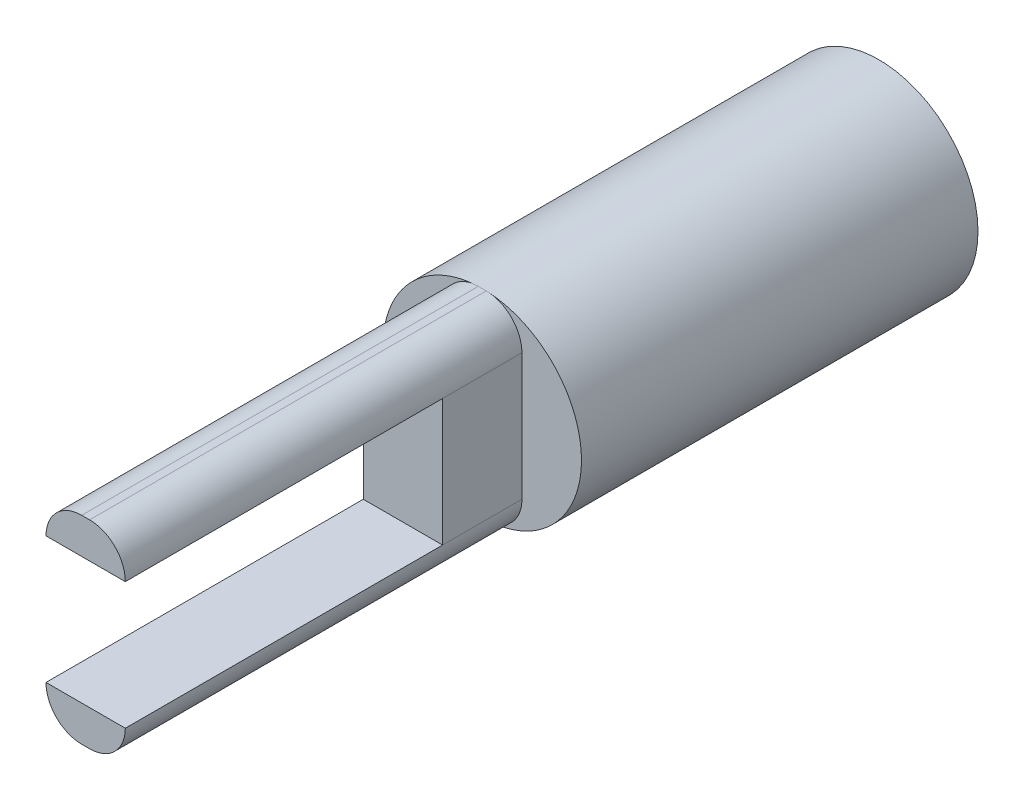
ISO-10303-21;
HEADER;
FILE_DESCRIPTION(('STEP AP214'),'2;1');
FILE_NAME('part.step','',(''),(''),'','','');
FILE_SCHEMA(('AUTOMOTIVE_DESIGN { 1 0 10303 214 1 1 1 1 }'));
ENDSEC;
DATA;
#1=APPLICATION_CONTEXT('core data for automotive mechanical design processes');
#2=APPLICATION_PROTOCOL_DEFINITION('international standard','automotive_design',2000,#1);
#3=PRODUCT_CONTEXT('',#1,'mechanical');
#4=PRODUCT('Part','Part','',(#3));
#5=PRODUCT_RELATED_PRODUCT_CATEGORY('part','',(#4));
#6=PRODUCT_DEFINITION_FORMATION('','',#4);
#7=PRODUCT_DEFINITION_CONTEXT('part definition',#1,'design');
#8=PRODUCT_DEFINITION('design','',#6,#7);
#9=PRODUCT_DEFINITION_SHAPE('','',#8);
#10=(LENGTH_UNIT() NAMED_UNIT(*) SI_UNIT(.MILLI.,.METRE.));
#11=(NAMED_UNIT(*) PLANE_ANGLE_UNIT() SI_UNIT($,.RADIAN.));
#12=(NAMED_UNIT(*) SI_UNIT($,.STERADIAN.) SOLID_ANGLE_UNIT());
#13=UNCERTAINTY_MEASURE_WITH_UNIT(LENGTH_MEASURE(1.E-05),#10,'distance_accuracy_value','');
#14=(GEOMETRIC_REPRESENTATION_CONTEXT(3) GLOBAL_UNCERTAINTY_ASSIGNED_CONTEXT((#13)) GLOBAL_UNIT_ASSIGNED_CONTEXT((#10,
#11,#12)) REPRESENTATION_CONTEXT('',''));
#15=CARTESIAN_POINT('',(0.,0.,0.));
#16=DIRECTION('',(0.,0.,1.));
#17=DIRECTION('',(1.,0.,0.));
#18=AXIS2_PLACEMENT_3D('',#15,#16,#17);
#19=CARTESIAN_POINT('',(-1.,-1.59999999999999,20.));
#20=DIRECTION('',(1.,0.,0.));
#21=DIRECTION('',(0.,0.,-1.));
#22=AXIS2_PLACEMENT_3D('',#19,#20,#21);
#23=PLANE('',#22);
#24=DIRECTION('',(0.,-1.,0.));
#25=VECTOR('',#24,1.);
#26=CARTESIAN_POINT('',(-1.,1.6,12.));
#27=LINE('',#26,#25);
#28=CARTESIAN_POINT('',(-1.,1.6,12.));
#29=VERTEX_POINT('',#28);
#30=CARTESIAN_POINT('',(-1.,-1.59999999999999,12.));
#31=VERTEX_POINT('',#30);
#32=EDGE_CURVE('E140',#29,#31,#27,.T.);
#33=ORIENTED_EDGE('',*,*,#32,.F.);
#34=DIRECTION('',(0.,0.,-1.));
#35=VECTOR('',#34,1.);
#36=CARTESIAN_POINT('',(-1.,1.59999999999999,20.));
#37=LINE('',#36,#35);
#38=CARTESIAN_POINT('',(-1.,1.59999999999999,10.));
#39=VERTEX_POINT('',#38);
#40=EDGE_CURVE('E165',#29,#39,#37,.T.);
#41=ORIENTED_EDGE('',*,*,#40,.T.);
#42=DIRECTION('',(0.,-1.,0.));
#43=VECTOR('',#42,1.);
#44=CARTESIAN_POINT('',(-1.,-1.59999999999999,10.));
#45=LINE('',#44,#43);
#46=CARTESIAN_POINT('',(-1.,-1.6,10.));
#47=VERTEX_POINT('',#46);
#48=EDGE_CURVE('E155',#39,#47,#45,.T.);
#49=ORIENTED_EDGE('',*,*,#48,.T.);
#50=DIRECTION('',(0.,0.,-1.));
#51=VECTOR('',#50,1.);
#52=CARTESIAN_POINT('',(-1.,-1.6,20.));
#53=LINE('',#52,#51);
#54=EDGE_CURVE('E153',#31,#47,#53,.T.);
#55=ORIENTED_EDGE('',*,*,#54,.F.);
#56=EDGE_LOOP('',(#33,#41,#49,#55));
#57=FACE_BOUND('',#56,.T.);
#58=ADVANCED_FACE('F33',(#57),#23,.F.);
#59=CARTESIAN_POINT('',(1.,-1.59999999999999,20.));
#60=DIRECTION('',(-1.,0.,0.));
#61=DIRECTION('',(0.,0.,1.));
#62=AXIS2_PLACEMENT_3D('',#59,#60,#61);
#63=PLANE('',#62);
#64=DIRECTION('',(0.,1.,0.));
#65=VECTOR('',#64,1.);
#66=CARTESIAN_POINT('',(1.,1.6,12.));
#67=LINE('',#66,#65);
#68=CARTESIAN_POINT('',(1.,-1.59999999999999,12.));
#69=VERTEX_POINT('',#68);
#70=CARTESIAN_POINT('',(1.,1.6,12.));
#71=VERTEX_POINT('',#70);
#72=EDGE_CURVE('E139',#69,#71,#67,.T.);
#73=ORIENTED_EDGE('',*,*,#72,.F.);
#74=DIRECTION('',(0.,0.,-1.));
#75=VECTOR('',#74,1.);
#76=CARTESIAN_POINT('',(1.,-1.59999999999999,20.));
#77=LINE('',#76,#75);
#78=CARTESIAN_POINT('',(1.,-1.59999999999999,10.));
#79=VERTEX_POINT('',#78);
#80=EDGE_CURVE('E61',#69,#79,#77,.T.);
#81=ORIENTED_EDGE('',*,*,#80,.T.);
#82=DIRECTION('',(0.,1.,0.));
#83=VECTOR('',#82,1.);
#84=CARTESIAN_POINT('',(1.,-1.59999999999999,10.));
#85=LINE('',#84,#83);
#86=CARTESIAN_POINT('',(1.,1.59999999999999,10.));
#87=VERTEX_POINT('',#86);
#88=EDGE_CURVE('E295',#79,#87,#85,.T.);
#89=ORIENTED_EDGE('',*,*,#88,.T.);
#90=DIRECTION('',(0.,0.,-1.));
#91=VECTOR('',#90,1.);
#92=CARTESIAN_POINT('',(1.,1.59999999999999,20.));
#93=LINE('',#92,#91);
#94=EDGE_CURVE('E53',#71,#87,#93,.T.);
#95=ORIENTED_EDGE('',*,*,#94,.F.);
#96=EDGE_LOOP('',(#73,#81,#89,#95));
#97=FACE_BOUND('',#96,.T.);
#98=ADVANCED_FACE('F203',(#97),#63,.F.);
#99=CARTESIAN_POINT('',(0.1,1.6,20.));
#100=DIRECTION('',(0.,0.,1.));
#101=DIRECTION('',(1.,0.,0.));
#102=AXIS2_PLACEMENT_3D('',#99,#100,#101);
#103=PLANE('',#102);
#104=DIRECTION('',(-1.,0.,0.));
#105=VECTOR('',#104,1.);
#106=CARTESIAN_POINT('',(-1.,1.6,20.));
#107=LINE('',#106,#105);
#108=CARTESIAN_POINT('',(1.,1.6,20.));
#109=VERTEX_POINT('',#108);
#110=CARTESIAN_POINT('',(-1.,1.6,20.));
#111=VERTEX_POINT('',#110);
#112=EDGE_CURVE('E150',#109,#111,#107,.T.);
#113=ORIENTED_EDGE('',*,*,#112,.F.);
#114=CARTESIAN_POINT('',(0.1,1.6,20.));
#115=DIRECTION('',(0.,0.,1.));
#116=DIRECTION('',(1.,0.,0.));
#117=AXIS2_PLACEMENT_3D('',#114,#115,#116);
#118=CIRCLE('',#117,0.9);
#119=CARTESIAN_POINT('',(0.0999999999999936,2.5,20.));
#120=VERTEX_POINT('',#119);
#121=EDGE_CURVE('E296',#109,#120,#118,.T.);
#122=ORIENTED_EDGE('',*,*,#121,.T.);
#123=DIRECTION('',(-1.,0.,0.));
#124=VECTOR('',#123,1.);
#125=CARTESIAN_POINT('',(-0.0999999999999936,2.5,20.));
#126=LINE('',#125,#124);
#127=CARTESIAN_POINT('',(-0.0999999999999938,2.5,20.));
#128=VERTEX_POINT('',#127);
#129=EDGE_CURVE('E316',#120,#128,#126,.T.);
#130=ORIENTED_EDGE('',*,*,#129,.T.);
#131=CARTESIAN_POINT('',(-0.1,1.6,20.));
#132=DIRECTION('',(0.,0.,1.));
#133=DIRECTION('',(-1.,0.,0.));
#134=AXIS2_PLACEMENT_3D('',#131,#132,#133);
#135=CIRCLE('',#134,0.9);
#136=EDGE_CURVE('E311',#128,#111,#135,.T.);
#137=ORIENTED_EDGE('',*,*,#136,.T.);
#138=EDGE_LOOP('',(#113,#122,#130,#137));
#139=FACE_BOUND('',#138,.T.);
#140=ADVANCED_FACE('F377',(#139),#103,.T.);
#141=CARTESIAN_POINT('',(0.,0.,10.));
#142=DIRECTION('',(0.,0.,1.));
#143=DIRECTION('',(1.,0.,0.));
#144=AXIS2_PLACEMENT_3D('',#141,#142,#143);
#145=PLANE('',#144);
#146=CARTESIAN_POINT('',(0.1,1.6,10.));
#147=DIRECTION('',(0.,0.,1.));
#148=DIRECTION('',(1.,0.,0.));
#149=AXIS2_PLACEMENT_3D('',#146,#147,#148);
#150=CIRCLE('',#149,0.9);
#151=CARTESIAN_POINT('',(0.154200368227142,2.49682906558571,10.));
#152=VERTEX_POINT('',#151);
#153=EDGE_CURVE('E324',#87,#152,#150,.T.);
#154=ORIENTED_EDGE('',*,*,#153,.F.);
#155=ORIENTED_EDGE('',*,*,#88,.F.);
#156=CARTESIAN_POINT('',(0.1,-1.6,10.));
#157=DIRECTION('',(0.,0.,1.));
#158=DIRECTION('',(-1.,0.,0.));
#159=AXIS2_PLACEMENT_3D('',#156,#157,#158);
#160=CIRCLE('',#159,0.9);
#161=CARTESIAN_POINT('',(0.154017291092777,-2.49685384413586,10.));
#162=VERTEX_POINT('',#161);
#163=EDGE_CURVE('E11',#162,#79,#160,.T.);
#164=ORIENTED_EDGE('',*,*,#163,.F.);
#165=CARTESIAN_POINT('',(0.153930582874639,-2.49541422306819,10.));
#166=CARTESIAN_POINT('',(0.180089926284761,-2.49383922626421,10.));
#167=CARTESIAN_POINT('',(0.206224798417091,-2.4918539223842,10.));
#168=CARTESIAN_POINT('',(0.25833882247195,-2.48706577852593,10.));
#169=CARTESIAN_POINT('',(0.284318206176433,-2.48426545984957,10.));
#170=CARTESIAN_POINT('',(0.336121320784231,-2.47784741196672,10.));
#171=CARTESIAN_POINT('',(0.361945262518701,-2.47423138591921,10.));
#172=CARTESIAN_POINT('',(0.413437497695465,-2.46618293559873,10.));
#173=CARTESIAN_POINT('',(0.439105927428948,-2.46175138338467,10.));
#174=CARTESIAN_POINT('',(0.490287233514523,-2.45207266449214,10.));
#175=CARTESIAN_POINT('',(0.515800117571482,-2.44682553855942,10.));
#176=CARTESIAN_POINT('',(0.566670452195333,-2.43551653144054,10.));
#177=CARTESIAN_POINT('',(0.592027729089221,-2.42945386921063,10.));
#178=CARTESIAN_POINT('',(0.642587101938854,-2.41651455770442,10.));
#179=CARTESIAN_POINT('',(0.667788792669843,-2.40963632496809,10.));
#180=CARTESIAN_POINT('',(0.71803700289691,-2.39506685212001,10.));
#181=CARTESIAN_POINT('',(0.74308283826312,-2.38737325559329,10.));
#182=CARTESIAN_POINT('',(0.799791382587595,-2.36897661503234,10.));
#183=CARTESIAN_POINT('',(0.831374865383541,-2.35802861786289,10.));
#184=CARTESIAN_POINT('',(0.89429406573422,-2.33482621795219,10.));
#185=CARTESIAN_POINT('',(0.92562679328646,-2.32256370664804,10.));
#186=CARTESIAN_POINT('',(0.974556859321199,-2.30231135794329,10.));
#187=CARTESIAN_POINT('',(0.992322391073726,-2.29472525694119,10.));
#188=CARTESIAN_POINT('',(1.02760983316791,-2.27918108356142,10.));
#189=CARTESIAN_POINT('',(1.04513241150138,-2.27122452934164,10.));
#190=CARTESIAN_POINT('',(1.08634259303384,-2.25194176950766,10.));
#191=CARTESIAN_POINT('',(1.1099502078175,-2.24044409955656,10.));
#192=CARTESIAN_POINT('',(1.15670821140675,-2.21675216864665,10.));
#193=CARTESIAN_POINT('',(1.17985992215578,-2.2045605155717,10.));
#194=CARTESIAN_POINT('',(1.22570668443226,-2.17948135294655,10.));
#195=CARTESIAN_POINT('',(1.24840275109754,-2.1665956997958,10.));
#196=CARTESIAN_POINT('',(1.29333845844632,-2.14012930365824,10.));
#197=CARTESIAN_POINT('',(1.31557875344578,-2.12654967165225,10.));
#198=CARTESIAN_POINT('',(1.35960332400282,-2.09869605179852,10.));
#199=CARTESIAN_POINT('',(1.38138784071828,-2.08442244514901,10.));
#200=CARTESIAN_POINT('',(1.42450122518608,-2.05518165297406,10.));
#201=CARTESIAN_POINT('',(1.44582987327673,-2.04021414362761,10.));
#202=CARTESIAN_POINT('',(1.48803216709234,-2.00958607132874,10.));
#203=CARTESIAN_POINT('',(1.50890509046508,-1.99392451264988,10.));
#204=CARTESIAN_POINT('',(1.5501957876239,-1.96190966560256,10.));
#205=CARTESIAN_POINT('',(1.57061229912965,-1.94555475243139,10.));
#206=CARTESIAN_POINT('',(1.62140134428726,-1.90354162502265,10.));
#207=CARTESIAN_POINT('',(1.65143177143943,-1.87746711524314,10.));
#208=CARTESIAN_POINT('',(1.69561071206345,-1.83725286010321,10.));
#209=CARTESIAN_POINT('',(1.71023058476098,-1.82362634561539,10.));
#210=CARTESIAN_POINT('',(1.73921162087477,-1.79597817258253,10.));
#211=CARTESIAN_POINT('',(1.75357141296026,-1.78195507516548,10.));
#212=CARTESIAN_POINT('',(1.79100347575016,-1.744542572309,10.));
#213=CARTESIAN_POINT('',(1.8137999006119,-1.7208760233458,10.));
#214=CARTESIAN_POINT('',(1.85832426707491,-1.67281523890592,10.));
#215=CARTESIAN_POINT('',(1.88005767566579,-1.64842606595597,10.));
#216=CARTESIAN_POINT('',(1.92245863415899,-1.59892213899614,10.));
#217=CARTESIAN_POINT('',(1.94313042133099,-1.57381101564894,10.));
#218=CARTESIAN_POINT('',(1.98340922817724,-1.52286407570858,10.));
#219=CARTESIAN_POINT('',(2.0030191049052,-1.49703051963803,10.));
#220=CARTESIAN_POINT('',(2.03744232012034,-1.44976634767625,10.));
#221=CARTESIAN_POINT('',(2.05244011801543,-1.42846978104604,10.));
#222=CARTESIAN_POINT('',(2.08174915428149,-1.38540982655762,10.));
#223=CARTESIAN_POINT('',(2.09606040784157,-1.36364644904256,10.));
#224=CARTESIAN_POINT('',(2.12399696507424,-1.31965326747859,10.));
#225=CARTESIAN_POINT('',(2.13762157393334,-1.29742302199231,10.));
#226=CARTESIAN_POINT('',(2.16418513267205,-1.25249771347051,10.));
#227=CARTESIAN_POINT('',(2.17712265533841,-1.22980180901157,10.));
#228=CARTESIAN_POINT('',(2.211884282756,-1.16651970693797,10.));
#229=CARTESIAN_POINT('',(2.23294739265826,-1.12551092606234,10.));
#230=CARTESIAN_POINT('',(2.26289616565917,-1.06306845287073,10.));
#231=CARTESIAN_POINT('',(2.27263093489886,-1.04203622257871,10.));
#232=CARTESIAN_POINT('',(2.29157494970301,-0.999613052566687,10.));
#233=CARTESIAN_POINT('',(2.30078141182319,-0.978220866424121,10.));
#234=CARTESIAN_POINT('',(2.3210610557865,-0.92929847433432,10.));
#235=CARTESIAN_POINT('',(2.33195402379699,-0.90169338820445,10.));
#236=CARTESIAN_POINT('',(2.35270876437727,-0.846272596702898,10.));
#237=CARTESIAN_POINT('',(2.36257591790481,-0.818458906800408,10.));
#238=CARTESIAN_POINT('',(2.38128118293929,-0.762621839295979,10.));
#239=CARTESIAN_POINT('',(2.39012357832139,-0.734599897389518,10.));
#240=CARTESIAN_POINT('',(2.4067801783159,-0.678346636186886,10.));
#241=CARTESIAN_POINT('',(2.41459749662938,-0.65011623969749,10.));
#242=CARTESIAN_POINT('',(2.42841259624306,-0.596521778576933,10.));
#243=CARTESIAN_POINT('',(2.43451596239188,-0.571184874157975,10.));
#244=CARTESIAN_POINT('',(2.44590793380641,-0.520345499685516,10.));
#245=CARTESIAN_POINT('',(2.45119705965442,-0.494843146373363,10.));
#246=CARTESIAN_POINT('',(2.46096131648891,-0.443673239959407,10.));
#247=CARTESIAN_POINT('',(2.46543614229653,-0.418005628639162,10.));
#248=CARTESIAN_POINT('',(2.47357264417792,-0.366505332987037,10.));
#249=CARTESIAN_POINT('',(2.47723318232403,-0.340672468909194,10.));
#250=CARTESIAN_POINT('',(2.48374082025524,-0.288850631697032,10.));
#251=CARTESIAN_POINT('',(2.48658623326998,-0.26286144686976,10.));
#252=CARTESIAN_POINT('',(2.49146614070186,-0.210718295768028,10.));
#253=CARTESIAN_POINT('',(2.49349785451315,-0.184564069539573,10.));
#254=CARTESIAN_POINT('',(2.49675105763346,-0.132090826751166,10.));
#255=CARTESIAN_POINT('',(2.49796897339933,-0.105771589065961,10.));
#256=CARTESIAN_POINT('',(2.49959579413407,-0.0529683236220053,10.));
#257=CARTESIAN_POINT('',(2.50000036687404,-0.0264841632128635,10.));
#258=CARTESIAN_POINT('',(2.49999963340755,0.0264638359497613,10.));
#259=CARTESIAN_POINT('',(2.49959494856527,0.0529276746989422,10.));
#260=CARTESIAN_POINT('',(2.49796630281903,0.105696739835719,10.));
#261=CARTESIAN_POINT('',(2.49674648279653,0.132002093215178,10.));
#262=CARTESIAN_POINT('',(2.49348874389048,0.184454021371798,10.));
#263=CARTESIAN_POINT('',(2.49145419620235,0.2106008051894,10.));
#264=CARTESIAN_POINT('',(2.48656766936257,0.262735532150638,10.));
#265=CARTESIAN_POINT('',(2.48371826453235,0.288723716331808,10.));
#266=CARTESIAN_POINT('',(2.47720396927173,0.340532420131744,10.));
#267=CARTESIAN_POINT('',(2.47354111365483,0.366353195480873,10.));
#268=CARTESIAN_POINT('',(2.465400184153,0.417836017017924,10.));
#269=CARTESIAN_POINT('',(2.46092303663927,0.443498209659874,10.));
#270=CARTESIAN_POINT('',(2.45115436018615,0.494663949130456,10.));
#271=CARTESIAN_POINT('',(2.44586292852092,0.520167514530534,10.));
#272=CARTESIAN_POINT('',(2.43446650983353,0.571016135102569,10.));
#273=CARTESIAN_POINT('',(2.42836080002875,0.596361028260877,10.));
#274=CARTESIAN_POINT('',(2.4153366605689,0.646892501381537,10.));
#275=CARTESIAN_POINT('',(2.40841670704259,0.672078688490805,10.));
#276=CARTESIAN_POINT('',(2.39376481381975,0.722292961532709,10.));
#277=CARTESIAN_POINT('',(2.38603057728965,0.747320377049497,10.));
#278=CARTESIAN_POINT('',(2.36975111735613,0.797217494616883,10.));
#279=CARTESIAN_POINT('',(2.36120286211719,0.822086207197474,10.));
#280=CARTESIAN_POINT('',(2.3432952091161,0.871665859387557,10.));
#281=CARTESIAN_POINT('',(2.33393208408709,0.896375451944043,10.));
#282=CARTESIAN_POINT('',(2.31442560062624,0.945570776961532,10.));
#283=CARTESIAN_POINT('',(2.30427997796195,0.970055611443603,10.));
#284=CARTESIAN_POINT('',(2.28328920009665,1.01857702347713,10.));
#285=CARTESIAN_POINT('',(2.27244783540735,1.04261524008448,10.));
#286=CARTESIAN_POINT('',(2.25006737970239,1.09023431738435,10.));
#287=CARTESIAN_POINT('',(2.23853160596797,1.11381673659273,10.));
#288=CARTESIAN_POINT('',(2.21476360081217,1.16052464965788,10.));
#289=CARTESIAN_POINT('',(2.20253393577021,1.18365144915422,10.));
#290=CARTESIAN_POINT('',(2.177378766986,1.22944832759491,10.));
#291=CARTESIAN_POINT('',(2.16445507860836,1.25211940349735,10.));
#292=CARTESIAN_POINT('',(2.13791265713354,1.29700517135395,10.));
#293=CARTESIAN_POINT('',(2.12429499452965,1.3192204962643,10.));
#294=CARTESIAN_POINT('',(2.09636536255805,1.36319513345601,10.));
#295=CARTESIAN_POINT('',(2.08205373502554,1.38495466284024,10.));
#296=CARTESIAN_POINT('',(2.05273690243299,1.42801813465652,10.));
#297=CARTESIAN_POINT('',(2.03773133578742,1.4493218309193,10.));
#298=CARTESIAN_POINT('',(2.00702732955732,1.49147411325581,10.));
#299=CARTESIAN_POINT('',(1.99132785877298,1.51232194812709,10.));
#300=CARTESIAN_POINT('',(1.95923668651721,1.55356300017301,10.));
#301=CARTESIAN_POINT('',(1.94284332567712,1.57395492592952,10.));
#302=CARTESIAN_POINT('',(1.90936507009597,1.6142847774765,10.));
#303=CARTESIAN_POINT('',(1.8922779362644,1.63422084420618,10.));
#304=CARTESIAN_POINT('',(1.85741240955289,1.67363927492625,10.));
#305=CARTESIAN_POINT('',(1.83963124988305,1.69311919102908,10.));
#306=CARTESIAN_POINT('',(1.80338095642158,1.73162516033215,10.));
#307=CARTESIAN_POINT('',(1.78490864772928,1.75064822356818,10.));
#308=CARTESIAN_POINT('',(1.74744680667039,1.78806328530264,10.));
#309=CARTESIAN_POINT('',(1.72845900425263,1.80645701567408,10.));
#310=CARTESIAN_POINT('',(1.69001309444968,1.84255435288995,10.));
#311=CARTESIAN_POINT('',(1.67055775154209,1.86026090287892,10.));
#312=CARTESIAN_POINT('',(1.63117829354243,1.89498519293892,10.));
#313=CARTESIAN_POINT('',(1.61125633695889,1.91200538045746,10.));
#314=CARTESIAN_POINT('',(1.5709440139932,1.94535722259717,10.));
#315=CARTESIAN_POINT('',(1.55055522058971,1.96169077810278,10.));
#316=CARTESIAN_POINT('',(1.5093098773615,1.99366997897575,10.));
#317=CARTESIAN_POINT('',(1.48845433729791,2.00931692654073,10.));
#318=CARTESIAN_POINT('',(1.44627604572933,2.039923505725,10.));
#319=CARTESIAN_POINT('',(1.42495377216344,2.05488379594116,10.));
#320=CARTESIAN_POINT('',(1.38184254735877,2.08411771989183,10.));
#321=CARTESIAN_POINT('',(1.36005358051626,2.09839133061548,10.));
#322=CARTESIAN_POINT('',(1.31600945407231,2.12625257919875,10.));
#323=CARTESIAN_POINT('',(1.29375382988149,2.13983948256668,10.));
#324=CARTESIAN_POINT('',(1.24877683690037,2.16632805064451,10.));
#325=CARTESIAN_POINT('',(1.22605460426377,2.17922824837101,10.));
#326=CARTESIAN_POINT('',(1.1801447589005,2.20434407505339,10.));
#327=CARTESIAN_POINT('',(1.15695593663002,2.21655749254647,10.));
#328=CARTESIAN_POINT('',(1.11011333981422,2.24030074521245,10.));
#329=CARTESIAN_POINT('',(1.08645806670937,2.2518276232263,10.));
#330=CARTESIAN_POINT('',(1.03868249407682,2.27419762787573,10.));
#331=CARTESIAN_POINT('',(1.01456046244362,2.28503705332983,10.));
#332=CARTESIAN_POINT('',(0.965936547060644,2.30600025694899,10.));
#333=CARTESIAN_POINT('',(0.941433870060147,2.31612219489074,10.));
#334=CARTESIAN_POINT('',(0.892261314659777,2.33554922474696,10.));
#335=CARTESIAN_POINT('',(0.867593080515431,2.34485847630581,10.));
#336=CARTESIAN_POINT('',(0.818086689632757,2.36266030552615,10.));
#337=CARTESIAN_POINT('',(0.793249766291936,2.37115631179516,10.));
#338=CARTESIAN_POINT('',(0.743406545658868,2.38733275864103,10.));
#339=CARTESIAN_POINT('',(0.718401130764762,2.39501591720509,10.));
#340=CARTESIAN_POINT('',(0.668221230305352,2.4095672777193,10.));
#341=CARTESIAN_POINT('',(0.643047315451914,2.41643744720309,10.));
#342=CARTESIAN_POINT('',(0.592530734417618,2.42936362250044,10.));
#343=CARTESIAN_POINT('',(0.567188370903949,2.43542081095737,10.));
#344=CARTESIAN_POINT('',(0.516335150703122,2.44672181398422,10.));
#345=CARTESIAN_POINT('',(0.490824376865484,2.45196600134111,10.));
#346=CARTESIAN_POINT('',(0.439634551301735,2.46164180805871,10.));
#347=CARTESIAN_POINT('',(0.41395541405787,2.46607297493712,10.));
#348=CARTESIAN_POINT('',(0.362429012927919,2.47412361652418,10.));
#349=CARTESIAN_POINT('',(0.336581548616961,2.47774180819254,10.));
#350=CARTESIAN_POINT('',(0.28471862930197,2.48416715139846,10.));
#351=CARTESIAN_POINT('',(0.258702913238083,2.48697219363253,10.));
#352=CARTESIAN_POINT('',(0.206503426561756,2.4917727299664,10.));
#353=CARTESIAN_POINT('',(0.18031938740135,2.49376530587613,10.));
#354=CARTESIAN_POINT('',(0.154110899409643,2.49534866726747,10.));
#355=B_SPLINE_CURVE_WITH_KNOTS('',3,(#165,#166,#167,#168,#169,#170,#171,#172,#173,#174,#175,
#176,#177,#178,#179,#180,#181,#182,#183,#184,#185,#186,#187,#188,#189,#190,#191,#192,#193,#194,
#195,#196,#197,#198,#199,#200,#201,#202,#203,#204,#205,#206,#207,#208,#209,#210,#211,#212,#213,
#214,#215,#216,#217,#218,#219,#220,#221,#222,#223,#224,#225,#226,#227,#228,#229,#230,#231,#232,
#233,#234,#235,#236,#237,#238,#239,#240,#241,#242,#243,#244,#245,#246,#247,#248,#249,#250,#251,
#252,#253,#254,#255,#256,#257,#258,#259,#260,#261,#262,#263,#264,#265,#266,#267,#268,#269,#270,
#271,#272,#273,#274,#275,#276,#277,#278,#279,#280,#281,#282,#283,#284,#285,#286,#287,#288,#289,
#290,#291,#292,#293,#294,#295,#296,#297,#298,#299,#300,#301,#302,#303,#304,#305,#306,#307,#308,
#309,#310,#311,#312,#313,#314,#315,#316,#317,#318,#319,#320,#321,#322,#323,#324,#325,#326,#327,
#328,#329,#330,#331,#332,#333,#334,#335,#336,#337,#338,#339,#340,#341,#342,#343,#344,#345,#346,
#347,#348,#349,#350,#351,#352,#353,#354),.UNSPECIFIED.,.F.,.F.,(4,2,2,2,2,2,2,2,2,2,2,2,2,2,2,2,
2,2,2,2,2,2,2,2,2,2,2,2,2,2,2,2,2,2,2,2,2,2,2,2,2,2,2,2,2,2,2,2,2,2,2,2,2,2,2,2,2,2,2,2,2,2,2,2,
2,2,2,2,2,2,2,2,2,2,2,2,2,2,2,2,2,2,2,2,2,2,2,2,2,2,2,2,2,2,4),(0.,0.0786172639541156,
0.156993859412629,0.23520829850859,0.313339582216948,0.391466963768667,0.469669708258433,
0.548026852072685,0.626616965771004,0.726871663937678,0.827784867096408,0.88573285151497,
0.94346129148541,1.02222375979768,1.10070762487278,1.17899107767733,1.2571529106412,
1.33527228419817,1.41342848779703,1.49170069896057,1.57016774403852,1.68942800170263,
1.74938036438718,1.8095887360803,1.90814315528659,2.00612145969105,2.1036722131452,
2.20094593848551,2.27907605865793,2.35720444948136,2.43541037298177,2.5137728559174,
2.65199536918737,2.72151644601705,2.79137533562345,2.88038678020224,2.96890486111185,
3.0570384276296,3.14489775817367,3.22306978488981,3.30119162309256,3.37934267933715,
3.45760227124012,3.53602265788787,3.61470878498925,3.69373820620772,3.77318746990301,
3.85257575428499,3.93156378185921,4.01022829380718,4.08864698110142,4.16687167362414,
4.2450079249914,4.32313484945935,4.40133158959311,4.47967707638024,4.55824979253486,
4.63712754249993,4.7163872324238,4.79588555541427,4.87498249775173,4.95372768647338,
5.03219853743014,5.11047328045964,5.18863073427043,5.26675007258961,5.34491058497318,
5.42319143586335,5.50167142553909,5.58042875653955,5.65954080894951,5.73907661647292,
5.81837229435441,5.89727892987266,5.97587346511732,6.05423376153861,6.13243838022275,
6.21056635187966,6.28869693980978,6.36690939935926,6.44528273749569,6.52389547613204,
6.60282542269578,6.68214945119029,6.76167007452788,6.84075635581121,6.91949299192928,
6.99795742393861,7.07622790085868,7.15438325427376,7.23250266428797,7.3106654202392,
7.38895067975981,7.46743722982998,7.54620325339989),.UNSPECIFIED.);
#356=EDGE_CURVE('E293',#162,#152,#355,.T.);
#357=ORIENTED_EDGE('',*,*,#356,.T.);
#358=EDGE_LOOP('',(#154,#155,#164,#357));
#359=FACE_BOUND('',#358,.T.);
#360=ADVANCED_FACE('F247',(#359),#145,.T.);
#361=CARTESIAN_POINT('',(0.,0.,10.));
#362=DIRECTION('',(0.,0.,-1.));
#363=DIRECTION('',(-1.,0.,0.));
#364=AXIS2_PLACEMENT_3D('',#361,#362,#363);
#365=CYLINDRICAL_SURFACE('',#364,2.5);
#366=CARTESIAN_POINT('',(0.1,1.6,10.));
#367=DIRECTION('',(0.,0.,1.));
#368=DIRECTION('',(0.0603255693325492,0.998178754374538,0.));
#369=AXIS2_PLACEMENT_3D('',#366,#367,#368);
#370=CIRCLE('',#369,0.9);
#371=CARTESIAN_POINT('',(0.0999609898911222,2.49900116072349,10.));
#372=VERTEX_POINT('',#371);
#373=EDGE_CURVE('E226',#152,#372,#370,.T.);
#374=ORIENTED_EDGE('',*,*,#373,.F.);
#375=ORIENTED_EDGE('',*,*,#356,.F.);
#376=CARTESIAN_POINT('',(0.1,-1.6,10.));
#377=DIRECTION('',(0.,0.,1.));
#378=DIRECTION('',(0.,-1.,0.));
#379=AXIS2_PLACEMENT_3D('',#376,#377,#378);
#380=CIRCLE('',#379,0.9);
#381=CARTESIAN_POINT('',(0.0999612358594318,-2.49900115088338,10.));
#382=VERTEX_POINT('',#381);
#383=EDGE_CURVE('E290',#382,#162,#380,.T.);
#384=ORIENTED_EDGE('',*,*,#383,.F.);
#385=CARTESIAN_POINT('',(-0.0999999999999936,-2.5,10.));
#386=DIRECTION('',(1.,0.,0.));
#387=VECTOR('',#386,1.);
#388=LINE('',#385,#387);
#389=CARTESIAN_POINT('',(-0.0999609898911218,-2.49900116072349,10.));
#390=VERTEX_POINT('',#389);
#391=EDGE_CURVE('E177',#390,#382,#388,.T.);
#392=ORIENTED_EDGE('',*,*,#391,.F.);
#393=CARTESIAN_POINT('',(-0.1,-1.6,10.));
#394=DIRECTION('',(0.,0.,1.));
#395=DIRECTION('',(-0.0603255693889432,-0.99817875437113,0.));
#396=AXIS2_PLACEMENT_3D('',#393,#394,#395);
#397=CIRCLE('',#396,0.9);
#398=CARTESIAN_POINT('',(-0.154200368277865,-2.49682906558262,10.));
#399=VERTEX_POINT('',#398);
#400=EDGE_CURVE('E366',#399,#390,#397,.T.);
#401=ORIENTED_EDGE('',*,*,#400,.F.);
#402=CARTESIAN_POINT('',(-0.153930556858307,2.49541422463514,10.));
#403=CARTESIAN_POINT('',(-0.193137753729967,2.49305575881048,10.));
#404=CARTESIAN_POINT('',(-0.232290212007418,2.48977229734747,10.));
#405=CARTESIAN_POINT('',(-0.310244427854528,2.48136446141892,10.));
#406=CARTESIAN_POINT('',(-0.349046955139013,2.47624721763132,10.));
#407=CARTESIAN_POINT('',(-0.426301528220296,2.46417246113907,10.));
#408=CARTESIAN_POINT('',(-0.464754034055278,2.45721789451037,10.));
#409=CARTESIAN_POINT('',(-0.541309002728116,2.44147363566876,10.));
#410=CARTESIAN_POINT('',(-0.579411207262782,2.43268268747852,10.));
#411=CARTESIAN_POINT('',(-0.655265891555827,2.41326980379218,10.));
#412=CARTESIAN_POINT('',(-0.693017001114073,2.40264252195267,10.));
#413=CARTESIAN_POINT('',(-0.768172529648739,2.37956044424122,10.));
#414=CARTESIAN_POINT('',(-0.805574122900895,2.3670964276813,10.));
#415=CARTESIAN_POINT('',(-0.861800890141157,2.34689488259641,10.));
#416=CARTESIAN_POINT('',(-0.880855666155556,2.33978943678037,10.));
#417=CARTESIAN_POINT('',(-0.918874360397918,2.32509772581448,10.));
#418=CARTESIAN_POINT('',(-0.937837526351173,2.31750950930865,10.));
#419=CARTESIAN_POINT('',(-0.974556689185645,2.30231154792755,10.));
#420=CARTESIAN_POINT('',(-0.992322401599287,2.29472526738296,10.));
#421=CARTESIAN_POINT('',(-1.02760980173962,2.27918108238473,10.));
#422=CARTESIAN_POINT('',(-1.04513215898331,2.27122469477484,10.));
#423=CARTESIAN_POINT('',(-1.0981984347264,2.24639417610109,10.));
#424=CARTESIAN_POINT('',(-1.13344851670022,2.22888606016889,10.));
#425=CARTESIAN_POINT('',(-1.20291732516407,2.19229985370245,10.));
#426=CARTESIAN_POINT('',(-1.23714002647419,2.17322929804642,10.));
#427=CARTESIAN_POINT('',(-1.30455748799643,2.13352144117865,10.));
#428=CARTESIAN_POINT('',(-1.33775445642181,2.11288789192336,10.));
#429=CARTESIAN_POINT('',(-1.40312184182545,2.07005797333745,10.));
#430=CARTESIAN_POINT('',(-1.43529231418296,2.04786168852396,10.));
#431=CARTESIAN_POINT('',(-1.4986088060186,2.001910164531,10.));
#432=CARTESIAN_POINT('',(-1.52975238498242,1.97815156425927,10.));
#433=CARTESIAN_POINT('',(-1.59101864652625,1.92907789282471,10.));
#434=CARTESIAN_POINT('',(-1.62113612771117,1.90375632271076,10.));
#435=CARTESIAN_POINT('',(-1.67068065750835,1.86008549679719,10.));
#436=CARTESIAN_POINT('',(-1.69043622479554,1.84210704615675,10.));
#437=CARTESIAN_POINT('',(-1.72948379093395,1.80544138639061,10.));
#438=CARTESIAN_POINT('',(-1.74877265582594,1.78675083291521,10.));
#439=CARTESIAN_POINT('',(-1.77688574789198,1.75865315913308,10.));
#440=CARTESIAN_POINT('',(-1.78593665159303,1.74947176016185,10.));
#441=CARTESIAN_POINT('',(-1.80387508314401,1.73099787451436,10.));
#442=CARTESIAN_POINT('',(-1.81276297905314,1.7217057448631,10.));
#443=CARTESIAN_POINT('',(-1.84861199893096,1.68365315633965,10.));
#444=CARTESIAN_POINT('',(-1.87498012270159,1.65432876706727,10.));
#445=CARTESIAN_POINT('',(-1.92616156159483,1.59462355340501,10.));
#446=CARTESIAN_POINT('',(-1.95098235048816,1.56424912395538,10.));
#447=CARTESIAN_POINT('',(-1.99907380890719,1.50244508795463,10.));
#448=CARTESIAN_POINT('',(-2.02234898907364,1.47101899438202,10.));
#449=CARTESIAN_POINT('',(-2.06735177506898,1.40711497852004,10.));
#450=CARTESIAN_POINT('',(-2.08908059447163,1.37463791081064,10.));
#451=CARTESIAN_POINT('',(-2.13099407454375,1.30863456865482,10.));
#452=CARTESIAN_POINT('',(-2.15117638865375,1.27510680445922,10.));
#453=CARTESIAN_POINT('',(-2.19000083179579,1.20700395137636,10.));
#454=CARTESIAN_POINT('',(-2.20863689206259,1.17242540215142,10.));
#455=CARTESIAN_POINT('',(-2.24144958488832,1.10796388662225,10.));
#456=CARTESIAN_POINT('',(-2.25586554178424,1.07820238804855,10.));
#457=CARTESIAN_POINT('',(-2.2836226099428,1.01794793528977,10.));
#458=CARTESIAN_POINT('',(-2.29695610863683,0.987451479432753,10.));
#459=CARTESIAN_POINT('',(-2.32731788998711,0.91420110828308,10.));
#460=CARTESIAN_POINT('',(-2.34380750697222,0.871222488211213,10.));
#461=CARTESIAN_POINT('',(-2.37429166041145,0.784744118075728,10.));
#462=CARTESIAN_POINT('',(-2.38830366582862,0.741250530847154,10.));
#463=CARTESIAN_POINT('',(-2.4120628504573,0.659845398082209,10.));
#464=CARTESIAN_POINT('',(-2.42213347621495,0.622027972201301,10.));
#465=CARTESIAN_POINT('',(-2.44044127298048,0.546012549389619,10.));
#466=CARTESIAN_POINT('',(-2.44868122843882,0.50781522404109,10.));
#467=CARTESIAN_POINT('',(-2.4633316192389,0.431041873982794,10.));
#468=CARTESIAN_POINT('',(-2.46974068010717,0.392465587136186,10.));
#469=CARTESIAN_POINT('',(-2.48073370218704,0.314935035622688,10.));
#470=CARTESIAN_POINT('',(-2.485312085591,0.27597998070704,10.));
#471=CARTESIAN_POINT('',(-2.49264553659167,0.197710183700347,10.));
#472=CARTESIAN_POINT('',(-2.4953917354112,0.158394612723771,10.));
#473=CARTESIAN_POINT('',(-2.49907101818129,0.0793865486838003,10.));
#474=CARTESIAN_POINT('',(-2.49999047250563,0.0396934262376391,10.));
#475=CARTESIAN_POINT('',(-2.50000951061197,-0.0396230908189098,10.));
#476=CARTESIAN_POINT('',(-2.49911231625652,-0.0792464843536347,10.));
#477=CARTESIAN_POINT('',(-2.49546522798478,-0.158143256156157,10.));
#478=CARTESIAN_POINT('',(-2.49272775893841,-0.197417203587539,10.));
#479=CARTESIAN_POINT('',(-2.48540846490929,-0.275596683796733,10.));
#480=CARTESIAN_POINT('',(-2.48083585308314,-0.31450307773407,10.));
#481=CARTESIAN_POINT('',(-2.46984971104915,-0.391965305420912,10.));
#482=CARTESIAN_POINT('',(-2.46344037725593,-0.430521733897309,10.));
#483=CARTESIAN_POINT('',(-2.44878511423209,-0.507284398229262,10.));
#484=CARTESIAN_POINT('',(-2.44053916937042,-0.545490631101488,10.));
#485=CARTESIAN_POINT('',(-2.42221528139678,-0.621553111487178,10.));
#486=CARTESIAN_POINT('',(-2.41213318830705,-0.659408357778283,10.));
#487=CARTESIAN_POINT('',(-2.38835204308349,-0.740896916470988,10.));
#488=CARTESIAN_POINT('',(-2.37433002459957,-0.784436225213691,10.));
#489=CARTESIAN_POINT('',(-2.34382856712648,-0.87104823021069,10.));
#490=CARTESIAN_POINT('',(-2.32732983274036,-0.914114126260564,10.));
#491=CARTESIAN_POINT('',(-2.29699199614922,-0.987406820819088,10.));
#492=CARTESIAN_POINT('',(-2.28369703593161,-1.0178601834172,10.));
#493=CARTESIAN_POINT('',(-2.25600052223302,-1.07804291105736,10.));
#494=CARTESIAN_POINT('',(-2.24160595384572,-1.1077754856965,10.));
#495=CARTESIAN_POINT('',(-2.20884390219527,-1.17215740547882,10.));
#496=CARTESIAN_POINT('',(-2.19023711129896,-1.20668530949662,10.));
#497=CARTESIAN_POINT('',(-2.15145576536219,-1.27471182549432,10.));
#498=CARTESIAN_POINT('',(-2.13128607799635,-1.30821321309181,10.));
#499=CARTESIAN_POINT('',(-2.08938280111911,-1.37418899889505,10.));
#500=CARTESIAN_POINT('',(-2.06765036590533,-1.40666413011679,10.));
#501=CARTESIAN_POINT('',(-2.02262518906856,-1.47058950477027,10.));
#502=CARTESIAN_POINT('',(-1.99933007981006,-1.50203808056943,10.));
#503=CARTESIAN_POINT('',(-1.95118352636556,-1.56391233083721,10.));
#504=CARTESIAN_POINT('',(-1.92632648093239,-1.59433364259679,10.));
#505=CARTESIAN_POINT('',(-1.87505741907218,-1.65415806689205,10.));
#506=CARTESIAN_POINT('',(-1.84863692135804,-1.68355392400714,10.));
#507=CARTESIAN_POINT('',(-1.81274132433161,-1.7216820884808,10.));
#508=CARTESIAN_POINT('',(-1.80385803298186,-1.73097681724883,10.));
#509=CARTESIAN_POINT('',(-1.78592846305135,-1.74945953290961,10.));
#510=CARTESIAN_POINT('',(-1.77688179099896,-1.75864713850779,10.));
#511=CARTESIAN_POINT('',(-1.74881054260353,-1.78673371295614,10.));
#512=CARTESIAN_POINT('',(-1.72955929524602,-1.80540725724202,10.));
#513=CARTESIAN_POINT('',(-1.69057385427713,-1.8420437847987,10.));
#514=CARTESIAN_POINT('',(-1.67084255008402,-1.86000984891891,10.));
#515=CARTESIAN_POINT('',(-1.62137699692032,-1.9036277335818,10.));
#516=CARTESIAN_POINT('',(-1.59131376850984,-1.92890834564215,10.));
#517=CARTESIAN_POINT('',(-1.53013231858832,-1.97791733168955,10.));
#518=CARTESIAN_POINT('',(-1.49901844378495,-2.00165113667232,10.));
#519=CARTESIAN_POINT('',(-1.43573779121337,-2.04757053621411,10.));
#520=CARTESIAN_POINT('',(-1.40357262764527,-2.06975835432096,10.));
#521=CARTESIAN_POINT('',(-1.33819222411809,-2.11258884291033,10.));
#522=CARTESIAN_POINT('',(-1.30497615340024,-2.13323024520542,10.));
#523=CARTESIAN_POINT('',(-1.23749676917574,-2.17297129566808,10.));
#524=CARTESIAN_POINT('',(-1.20323054018235,-2.19206598935607,10.));
#525=CARTESIAN_POINT('',(-1.13365100282718,-2.22871820677419,10.));
#526=CARTESIAN_POINT('',(-1.09833309102563,-2.2462670052079,10.));
#527=CARTESIAN_POINT('',(-1.04519043657092,-2.27115058488075,10.));
#528=CARTESIAN_POINT('',(-1.02765915161984,-2.2791181268612,10.));
#529=CARTESIAN_POINT('',(-0.992349488874494,-2.29469094079911,10.));
#530=CARTESIAN_POINT('',(-0.974570389413041,-2.30229457982944,10.));
#531=CARTESIAN_POINT('',(-0.937862131976946,-2.31751124550461,10.));
#532=CARTESIAN_POINT('',(-0.918923603916849,-2.32510168358232,10.));
#533=CARTESIAN_POINT('',(-0.880945867364884,-2.33979675394681,10.));
#534=CARTESIAN_POINT('',(-0.861907357551105,-2.34690319607836,10.));
#535=CARTESIAN_POINT('',(-0.80577255198407,-2.36708789536179,10.));
#536=CARTESIAN_POINT('',(-0.768446108653835,-2.37953302431093,10.));
#537=CARTESIAN_POINT('',(-0.693412392932508,-2.40258410642258,10.));
#538=CARTESIAN_POINT('',(-0.655707551242042,-2.41319798984568,10.));
#539=CARTESIAN_POINT('',(-0.579916965655276,-2.43259118997395,10.));
#540=CARTESIAN_POINT('',(-0.541832244837,-2.44137449985849,10.));
#541=CARTESIAN_POINT('',(-0.465283719959091,-2.4571105762113,10.));
#542=CARTESIAN_POINT('',(-0.426819889151342,-2.46406321254322,10.));
#543=CARTESIAN_POINT('',(-0.349514115755959,-2.47614125649421,10.));
#544=CARTESIAN_POINT('',(-0.310671496802983,-2.48126232966373,10.));
#545=CARTESIAN_POINT('',(-0.232608347240732,-2.48968490927307,10.));
#546=CARTESIAN_POINT('',(-0.193386900058686,-2.49297792919871,10.));
#547=CARTESIAN_POINT('',(-0.154110899460337,-2.4953486672644,10.));
#548=B_SPLINE_CURVE_WITH_KNOTS('',3,(#402,#403,#404,#405,#406,#407,#408,#409,#410,#411,#412,
#413,#414,#415,#416,#417,#418,#419,#420,#421,#422,#423,#424,#425,#426,#427,#428,#429,#430,#431,
#432,#433,#434,#435,#436,#437,#438,#439,#440,#441,#442,#443,#444,#445,#446,#447,#448,#449,#450,
#451,#452,#453,#454,#455,#456,#457,#458,#459,#460,#461,#462,#463,#464,#465,#466,#467,#468,#469,
#470,#471,#472,#473,#474,#475,#476,#477,#478,#479,#480,#481,#482,#483,#484,#485,#486,#487,#488,
#489,#490,#491,#492,#493,#494,#495,#496,#497,#498,#499,#500,#501,#502,#503,#504,#505,#506,#507,
#508,#509,#510,#511,#512,#513,#514,#515,#516,#517,#518,#519,#520,#521,#522,#523,#524,#525,#526,
#527,#528,#529,#530,#531,#532,#533,#534,#535,#536,#537,#538,#539,#540,#541,#542,#543,#544,#545,
#546,#547),.UNSPECIFIED.,.F.,.F.,(4,2,2,2,2,2,2,2,2,2,2,2,2,2,2,2,2,2,2,2,2,2,2,2,2,2,2,2,2,2,2,
2,2,2,2,2,2,2,2,2,2,2,2,2,2,2,2,2,2,2,2,2,2,2,2,2,2,2,2,2,2,2,2,2,2,2,2,2,2,2,2,2,4),(0.,
0.117824658173663,0.235196039058738,0.352380349862415,0.46964507182401,0.587257137554793,
0.705481126933973,0.76648579682963,0.827754999286834,0.885702972235824,0.943431400817903,
1.06145969415814,1.17894897760443,1.29616465953806,1.41337400698163,1.53084433019419,
1.64884116580308,1.72896409122192,1.80952612992707,1.84820240756508,1.886776637336,
2.00503609501169,2.12267119072909,2.23994634935047,2.35712843238978,2.47448493630724,
2.59228216933314,2.6914645867136,2.79129302521815,2.92932342643838,3.06633802157147,
3.18370071970866,3.30088366807822,3.41815435722799,3.53577967911608,3.65397031910869,
3.77303953498418,3.89189776420647,4.00996145941237,4.12743969715996,4.24465163997128,
4.36186458038941,4.47934580414818,4.61650093681947,4.75478612387842,4.85444961018195,
4.95352560288267,5.07114729782191,5.18841634332194,5.30559964253789,5.42296468362046,
5.54077771682149,5.65930197335269,5.69787231877402,5.73655297191691,5.81699832173638,
5.89704223037485,6.01483519808668,6.13218941349136,6.24937120036403,6.36664805718851,
6.48428683391251,6.60255193063231,6.6603186627283,6.71832408617606,6.77952708535654,
6.8404869895515,6.95847892448863,7.07594631596335,7.1931547204405,7.31037145461619,
7.42786377833176,7.54589707941197),.UNSPECIFIED.);
#549=CARTESIAN_POINT('',(-0.154017265034451,2.49685384571481,10.));
#550=VERTEX_POINT('',#549);
#551=EDGE_CURVE('E270',#550,#399,#548,.T.);
#552=ORIENTED_EDGE('',*,*,#551,.F.);
#553=CARTESIAN_POINT('',(-0.1,1.6,10.));
#554=DIRECTION('',(0.,0.,1.));
#555=DIRECTION('',(0.,1.,0.));
#556=AXIS2_PLACEMENT_3D('',#553,#554,#555);
#557=CIRCLE('',#556,0.9);
#558=CARTESIAN_POINT('',(-0.0999612358594316,2.49900115088338,10.));
#559=VERTEX_POINT('',#558);
#560=EDGE_CURVE('E298',#559,#550,#557,.T.);
#561=ORIENTED_EDGE('',*,*,#560,.F.);
#562=CARTESIAN_POINT('',(0.0999999999999936,2.5,10.));
#563=DIRECTION('',(-1.,0.,0.));
#564=VECTOR('',#563,1.);
#565=LINE('',#562,#564);
#566=EDGE_CURVE('E300',#372,#559,#565,.T.);
#567=ORIENTED_EDGE('',*,*,#566,.F.);
#568=EDGE_LOOP('',(#374,#375,#384,#392,#401,#552,#561,#567));
#569=FACE_BOUND('',#568,.T.);
#570=CARTESIAN_POINT('',(0.,0.,0.));
#571=DIRECTION('',(0.,0.,1.));
#572=DIRECTION('',(1.,0.,0.));
#573=AXIS2_PLACEMENT_3D('',#570,#571,#572);
#574=CIRCLE('',#573,2.5);
#575=CARTESIAN_POINT('',(2.5,0.,0.));
#576=VERTEX_POINT('',#575);
#577=EDGE_CURVE('E253',#576,#576,#574,.T.);
#578=ORIENTED_EDGE('',*,*,#577,.T.);
#579=EDGE_LOOP('',(#578));
#580=FACE_BOUND('',#579,.T.);
#581=ADVANCED_FACE('F35',(#569,#580),#365,.T.);
#582=CARTESIAN_POINT('',(-0.1,-1.6,10.));
#583=DIRECTION('',(0.,0.,1.));
#584=DIRECTION('',(-1.,0.,0.));
#585=AXIS2_PLACEMENT_3D('',#582,#583,#584);
#586=CIRCLE('',#585,0.9);
#587=EDGE_CURVE('E183',#47,#399,#586,.T.);
#588=ORIENTED_EDGE('',*,*,#587,.F.);
#589=ORIENTED_EDGE('',*,*,#48,.F.);
#590=CARTESIAN_POINT('',(-0.1,1.6,10.));
#591=DIRECTION('',(0.,0.,1.));
#592=DIRECTION('',(-1.,0.,0.));
#593=AXIS2_PLACEMENT_3D('',#590,#591,#592);
#594=CIRCLE('',#593,0.9);
#595=EDGE_CURVE('E45',#550,#39,#594,.T.);
#596=ORIENTED_EDGE('',*,*,#595,.F.);
#597=ORIENTED_EDGE('',*,*,#551,.T.);
#598=EDGE_LOOP('',(#588,#589,#596,#597));
#599=FACE_BOUND('',#598,.T.);
#600=ADVANCED_FACE('F243',(#599),#145,.T.);
#601=CARTESIAN_POINT('',(0.,0.,0.));
#602=DIRECTION('',(0.,0.,1.));
#603=DIRECTION('',(1.,0.,0.));
#604=AXIS2_PLACEMENT_3D('',#601,#602,#603);
#605=PLANE('',#604);
#606=ORIENTED_EDGE('',*,*,#577,.F.);
#607=EDGE_LOOP('',(#606));
#608=FACE_BOUND('',#607,.T.);
#609=ADVANCED_FACE('F242',(#608),#605,.F.);
#610=CARTESIAN_POINT('',(0.1,1.6,20.));
#611=DIRECTION('',(0.,0.,-1.));
#612=DIRECTION('',(-1.,0.,0.));
#613=AXIS2_PLACEMENT_3D('',#610,#611,#612);
#614=CYLINDRICAL_SURFACE('',#613,0.9);
#615=ORIENTED_EDGE('',*,*,#153,.T.);
#616=ORIENTED_EDGE('',*,*,#373,.T.);
#617=DIRECTION('',(0.,0.,-1.));
#618=VECTOR('',#617,1.);
#619=CARTESIAN_POINT('',(0.0999999999999936,2.5,20.));
#620=LINE('',#619,#618);
#621=EDGE_CURVE('E350',#120,#372,#620,.T.);
#622=ORIENTED_EDGE('',*,*,#621,.F.);
#623=ORIENTED_EDGE('',*,*,#121,.F.);
#624=EDGE_CURVE('E304',#109,#71,#93,.T.);
#625=ORIENTED_EDGE('',*,*,#624,.T.);
#626=ORIENTED_EDGE('',*,*,#94,.T.);
#627=EDGE_LOOP('',(#615,#616,#622,#623,#625,#626));
#628=FACE_BOUND('',#627,.T.);
#629=ADVANCED_FACE('F233',(#628),#614,.T.);
#630=CARTESIAN_POINT('',(-0.0999999999999936,2.5,20.));
#631=DIRECTION('',(0.,-1.,0.));
#632=DIRECTION('',(0.,0.,-1.));
#633=AXIS2_PLACEMENT_3D('',#630,#631,#632);
#634=PLANE('',#633);
#635=ORIENTED_EDGE('',*,*,#566,.T.);
#636=DIRECTION('',(0.,0.,-1.));
#637=VECTOR('',#636,1.);
#638=CARTESIAN_POINT('',(-0.0999999999999938,2.5,20.));
#639=LINE('',#638,#637);
#640=EDGE_CURVE('E171',#128,#559,#639,.T.);
#641=ORIENTED_EDGE('',*,*,#640,.F.);
#642=ORIENTED_EDGE('',*,*,#129,.F.);
#643=ORIENTED_EDGE('',*,*,#621,.T.);
#644=EDGE_LOOP('',(#635,#641,#642,#643));
#645=FACE_BOUND('',#644,.T.);
#646=ADVANCED_FACE('F207',(#645),#634,.F.);
#647=CARTESIAN_POINT('',(-0.1,1.6,20.));
#648=DIRECTION('',(0.,0.,-1.));
#649=DIRECTION('',(-1.,0.,0.));
#650=AXIS2_PLACEMENT_3D('',#647,#648,#649);
#651=CYLINDRICAL_SURFACE('',#650,0.9);
#652=ORIENTED_EDGE('',*,*,#560,.T.);
#653=ORIENTED_EDGE('',*,*,#595,.T.);
#654=ORIENTED_EDGE('',*,*,#40,.F.);
#655=EDGE_CURVE('E166',#111,#29,#37,.T.);
#656=ORIENTED_EDGE('',*,*,#655,.F.);
#657=ORIENTED_EDGE('',*,*,#136,.F.);
#658=ORIENTED_EDGE('',*,*,#640,.T.);
#659=EDGE_LOOP('',(#652,#653,#654,#656,#657,#658));
#660=FACE_BOUND('',#659,.T.);
#661=ADVANCED_FACE('F200',(#660),#651,.T.);
#662=CARTESIAN_POINT('',(-0.1,-1.6,20.));
#663=DIRECTION('',(0.,0.,-1.));
#664=DIRECTION('',(-1.,0.,0.));
#665=AXIS2_PLACEMENT_3D('',#662,#663,#664);
#666=CYLINDRICAL_SURFACE('',#665,0.9);
#667=ORIENTED_EDGE('',*,*,#587,.T.);
#668=ORIENTED_EDGE('',*,*,#400,.T.);
#669=DIRECTION('',(0.,0.,-1.));
#670=VECTOR('',#669,1.);
#671=CARTESIAN_POINT('',(-0.0999999999999936,-2.5,20.));
#672=LINE('',#671,#670);
#673=CARTESIAN_POINT('',(-0.0999999999999936,-2.5,20.));
#674=VERTEX_POINT('',#673);
#675=EDGE_CURVE('E159',#674,#390,#672,.T.);
#676=ORIENTED_EDGE('',*,*,#675,.F.);
#677=CARTESIAN_POINT('',(-0.1,-1.6,20.));
#678=DIRECTION('',(0.,0.,1.));
#679=DIRECTION('',(-1.,0.,0.));
#680=AXIS2_PLACEMENT_3D('',#677,#678,#679);
#681=CIRCLE('',#680,0.9);
#682=CARTESIAN_POINT('',(-1.,-1.6,20.));
#683=VERTEX_POINT('',#682);
#684=EDGE_CURVE('E164',#683,#674,#681,.T.);
#685=ORIENTED_EDGE('',*,*,#684,.F.);
#686=EDGE_CURVE('E134',#683,#31,#53,.T.);
#687=ORIENTED_EDGE('',*,*,#686,.T.);
#688=ORIENTED_EDGE('',*,*,#54,.T.);
#689=EDGE_LOOP('',(#667,#668,#676,#685,#687,#688));
#690=FACE_BOUND('',#689,.T.);
#691=ADVANCED_FACE('F162',(#690),#666,.T.);
#692=CARTESIAN_POINT('',(-0.0999999999999936,-2.5,20.));
#693=DIRECTION('',(0.,1.,0.));
#694=DIRECTION('',(0.,0.,1.));
#695=AXIS2_PLACEMENT_3D('',#692,#693,#694);
#696=PLANE('',#695);
#697=ORIENTED_EDGE('',*,*,#391,.T.);
#698=DIRECTION('',(0.,0.,-1.));
#699=VECTOR('',#698,1.);
#700=CARTESIAN_POINT('',(0.0999999999999939,-2.5,20.));
#701=LINE('',#700,#699);
#702=CARTESIAN_POINT('',(0.0999999999999939,-2.5,20.));
#703=VERTEX_POINT('',#702);
#704=EDGE_CURVE('E330',#703,#382,#701,.T.);
#705=ORIENTED_EDGE('',*,*,#704,.F.);
#706=DIRECTION('',(1.,0.,0.));
#707=VECTOR('',#706,1.);
#708=CARTESIAN_POINT('',(-0.0999999999999936,-2.5,20.));
#709=LINE('',#708,#707);
#710=EDGE_CURVE('E307',#674,#703,#709,.T.);
#711=ORIENTED_EDGE('',*,*,#710,.F.);
#712=ORIENTED_EDGE('',*,*,#675,.T.);
#713=EDGE_LOOP('',(#697,#705,#711,#712));
#714=FACE_BOUND('',#713,.T.);
#715=ADVANCED_FACE('F185',(#714),#696,.F.);
#716=CARTESIAN_POINT('',(0.1,-1.6,20.));
#717=DIRECTION('',(0.,0.,-1.));
#718=DIRECTION('',(-1.,0.,0.));
#719=AXIS2_PLACEMENT_3D('',#716,#717,#718);
#720=CYLINDRICAL_SURFACE('',#719,0.9);
#721=ORIENTED_EDGE('',*,*,#383,.T.);
#722=ORIENTED_EDGE('',*,*,#163,.T.);
#723=ORIENTED_EDGE('',*,*,#80,.F.);
#724=CARTESIAN_POINT('',(1.,-1.59999999999999,20.));
#725=VERTEX_POINT('',#724);
#726=EDGE_CURVE('E137',#725,#69,#77,.T.);
#727=ORIENTED_EDGE('',*,*,#726,.F.);
#728=CARTESIAN_POINT('',(0.1,-1.6,20.));
#729=DIRECTION('',(0.,0.,1.));
#730=DIRECTION('',(-1.,0.,0.));
#731=AXIS2_PLACEMENT_3D('',#728,#729,#730);
#732=CIRCLE('',#731,0.9);
#733=EDGE_CURVE('E302',#703,#725,#732,.T.);
#734=ORIENTED_EDGE('',*,*,#733,.F.);
#735=ORIENTED_EDGE('',*,*,#704,.T.);
#736=EDGE_LOOP('',(#721,#722,#723,#727,#734,#735));
#737=FACE_BOUND('',#736,.T.);
#738=ADVANCED_FACE('F194',(#737),#720,.T.);
#739=DIRECTION('',(1.,0.,0.));
#740=VECTOR('',#739,1.);
#741=CARTESIAN_POINT('',(-1.,-1.59999999999999,20.));
#742=LINE('',#741,#740);
#743=EDGE_CURVE('E321',#683,#725,#742,.T.);
#744=ORIENTED_EDGE('',*,*,#743,.F.);
#745=ORIENTED_EDGE('',*,*,#684,.T.);
#746=ORIENTED_EDGE('',*,*,#710,.T.);
#747=ORIENTED_EDGE('',*,*,#733,.T.);
#748=EDGE_LOOP('',(#744,#745,#746,#747));
#749=FACE_BOUND('',#748,.T.);
#750=ADVANCED_FACE('F380',(#749),#103,.T.);
#751=CARTESIAN_POINT('',(-1.,1.6,12.));
#752=DIRECTION('',(0.,1.,0.));
#753=DIRECTION('',(0.,0.,1.));
#754=AXIS2_PLACEMENT_3D('',#751,#752,#753);
#755=PLANE('',#754);
#756=ORIENTED_EDGE('',*,*,#112,.T.);
#757=ORIENTED_EDGE('',*,*,#655,.T.);
#758=DIRECTION('',(-1.,0.,0.));
#759=VECTOR('',#758,1.);
#760=CARTESIAN_POINT('',(-1.,1.6,12.));
#761=LINE('',#760,#759);
#762=EDGE_CURVE('E147',#71,#29,#761,.T.);
#763=ORIENTED_EDGE('',*,*,#762,.F.);
#764=ORIENTED_EDGE('',*,*,#624,.F.);
#765=EDGE_LOOP('',(#756,#757,#763,#764));
#766=FACE_BOUND('',#765,.T.);
#767=ADVANCED_FACE('F326',(#766),#755,.F.);
#768=CARTESIAN_POINT('',(-1.,-1.59999999999999,12.));
#769=DIRECTION('',(0.,-1.,0.));
#770=DIRECTION('',(0.,0.,-1.));
#771=AXIS2_PLACEMENT_3D('',#768,#769,#770);
#772=PLANE('',#771);
#773=ORIENTED_EDGE('',*,*,#743,.T.);
#774=ORIENTED_EDGE('',*,*,#726,.T.);
#775=DIRECTION('',(1.,0.,0.));
#776=VECTOR('',#775,1.);
#777=CARTESIAN_POINT('',(-1.,-1.59999999999999,12.));
#778=LINE('',#777,#776);
#779=EDGE_CURVE('E130',#31,#69,#778,.T.);
#780=ORIENTED_EDGE('',*,*,#779,.F.);
#781=ORIENTED_EDGE('',*,*,#686,.F.);
#782=EDGE_LOOP('',(#773,#774,#780,#781));
#783=FACE_BOUND('',#782,.T.);
#784=ADVANCED_FACE('F132',(#783),#772,.F.);
#785=CARTESIAN_POINT('',(0.,0.,12.));
#786=DIRECTION('',(0.,0.,1.));
#787=DIRECTION('',(1.,0.,0.));
#788=AXIS2_PLACEMENT_3D('',#785,#786,#787);
#789=PLANE('',#788);
#790=ORIENTED_EDGE('',*,*,#32,.T.);
#791=ORIENTED_EDGE('',*,*,#779,.T.);
#792=ORIENTED_EDGE('',*,*,#72,.T.);
#793=ORIENTED_EDGE('',*,*,#762,.T.);
#794=EDGE_LOOP('',(#790,#791,#792,#793));
#795=FACE_BOUND('',#794,.T.);
#796=ADVANCED_FACE('F145',(#795),#789,.T.);
#797=CLOSED_SHELL('',(#58,#98,#140,#360,#581,#600,#609,#629,#646,#661,#691,#715,#738,#750,#767,
#784,#796));
#798=MANIFOLD_SOLID_BREP('B2',#797);
#799=ADVANCED_BREP_SHAPE_REPRESENTATION('',(#18,#798),#14);
#800=SHAPE_DEFINITION_REPRESENTATION(#9,#799);
ENDSEC;
END-ISO-10303-21;
